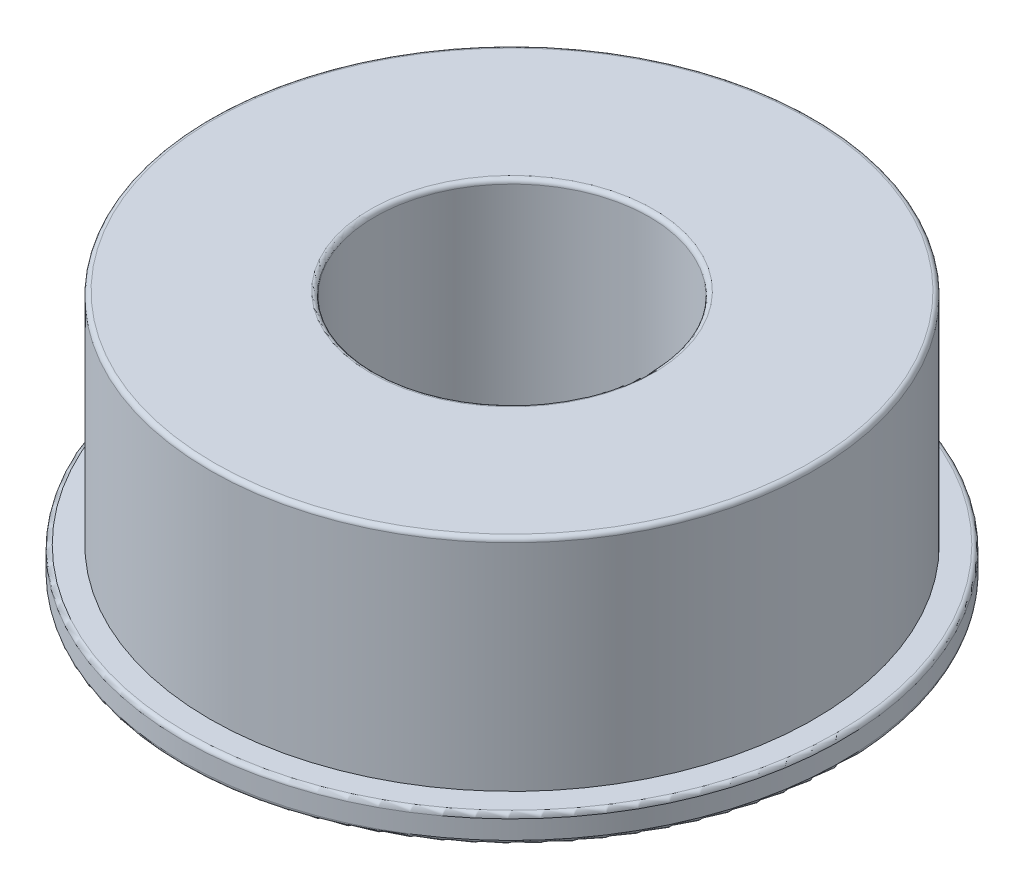
ISO-10303-21;
HEADER;
FILE_DESCRIPTION(('STEP AP214'),'2;1');
FILE_NAME('part.step','',(''),(''),'','','');
FILE_SCHEMA(('AUTOMOTIVE_DESIGN { 1 0 10303 214 1 1 1 1 }'));
ENDSEC;
DATA;
#1=APPLICATION_CONTEXT('core data for automotive mechanical design processes');
#2=APPLICATION_PROTOCOL_DEFINITION('international standard','automotive_design',2000,#1);
#3=PRODUCT_CONTEXT('',#1,'mechanical');
#4=PRODUCT('Part','Part','',(#3));
#5=PRODUCT_RELATED_PRODUCT_CATEGORY('part','',(#4));
#6=PRODUCT_DEFINITION_FORMATION('','',#4);
#7=PRODUCT_DEFINITION_CONTEXT('part definition',#1,'design');
#8=PRODUCT_DEFINITION('design','',#6,#7);
#9=PRODUCT_DEFINITION_SHAPE('','',#8);
#10=(LENGTH_UNIT() NAMED_UNIT(*) SI_UNIT(.MILLI.,.METRE.));
#11=(NAMED_UNIT(*) PLANE_ANGLE_UNIT() SI_UNIT($,.RADIAN.));
#12=(NAMED_UNIT(*) SI_UNIT($,.STERADIAN.) SOLID_ANGLE_UNIT());
#13=UNCERTAINTY_MEASURE_WITH_UNIT(LENGTH_MEASURE(1.E-05),#10,'distance_accuracy_value','');
#14=(GEOMETRIC_REPRESENTATION_CONTEXT(3) GLOBAL_UNCERTAINTY_ASSIGNED_CONTEXT((#13)) GLOBAL_UNIT_ASSIGNED_CONTEXT((#10,
#11,#12)) REPRESENTATION_CONTEXT('',''));
#15=CARTESIAN_POINT('',(0.,0.,0.));
#16=DIRECTION('',(0.,0.,1.));
#17=DIRECTION('',(1.,0.,0.));
#18=AXIS2_PLACEMENT_3D('',#15,#16,#17);
#19=CARTESIAN_POINT('',(0.,1.5875,0.));
#20=DIRECTION('',(0.,1.,0.));
#21=DIRECTION('',(0.,0.,1.));
#22=AXIS2_PLACEMENT_3D('',#19,#20,#21);
#23=PLANE('',#22);
#24=CARTESIAN_POINT('',(0.,1.5875,0.));
#25=DIRECTION('',(0.,1.,0.));
#26=DIRECTION('',(0.,0.,1.));
#27=AXIS2_PLACEMENT_3D('',#24,#25,#26);
#28=CIRCLE('',#27,18.796);
#29=CARTESIAN_POINT('',(0.,1.5875,18.796));
#30=VERTEX_POINT('',#29);
#31=EDGE_CURVE('E38',#30,#30,#28,.T.);
#32=ORIENTED_EDGE('',*,*,#31,.T.);
#33=EDGE_LOOP('',(#32));
#34=FACE_BOUND('',#33,.T.);
#35=CARTESIAN_POINT('',(0.,1.5875,0.));
#36=DIRECTION('',(0.,1.,0.));
#37=DIRECTION('',(0.,0.,1.));
#38=AXIS2_PLACEMENT_3D('',#35,#36,#37);
#39=CIRCLE('',#38,17.4625);
#40=CARTESIAN_POINT('',(0.,1.5875,17.4625));
#41=VERTEX_POINT('',#40);
#42=EDGE_CURVE('E63',#41,#41,#39,.T.);
#43=ORIENTED_EDGE('',*,*,#42,.F.);
#44=EDGE_LOOP('',(#43));
#45=FACE_BOUND('',#44,.T.);
#46=ADVANCED_FACE('F31',(#34,#45),#23,.T.);
#47=CARTESIAN_POINT('',(0.,1.5875,0.));
#48=DIRECTION('',(0.,-1.,0.));
#49=DIRECTION('',(0.,0.,-1.));
#50=AXIS2_PLACEMENT_3D('',#47,#48,#49);
#51=CYLINDRICAL_SURFACE('',#50,19.05);
#52=CARTESIAN_POINT('',(0.,0.254,0.));
#53=DIRECTION('',(0.,1.,0.));
#54=DIRECTION('',(0.,0.,1.));
#55=AXIS2_PLACEMENT_3D('',#52,#53,#54);
#56=CIRCLE('',#55,19.05);
#57=CARTESIAN_POINT('',(0.,0.254,19.05));
#58=VERTEX_POINT('',#57);
#59=EDGE_CURVE('E46',#58,#58,#56,.T.);
#60=ORIENTED_EDGE('',*,*,#59,.T.);
#61=EDGE_LOOP('',(#60));
#62=FACE_BOUND('',#61,.T.);
#63=CARTESIAN_POINT('',(0.,1.3335,0.));
#64=DIRECTION('',(0.,1.,0.));
#65=DIRECTION('',(0.,0.,1.));
#66=AXIS2_PLACEMENT_3D('',#63,#64,#65);
#67=CIRCLE('',#66,19.05);
#68=CARTESIAN_POINT('',(0.,1.3335,19.05));
#69=VERTEX_POINT('',#68);
#70=EDGE_CURVE('E51',#69,#69,#67,.F.);
#71=ORIENTED_EDGE('',*,*,#70,.T.);
#72=EDGE_LOOP('',(#71));
#73=FACE_BOUND('',#72,.T.);
#74=ADVANCED_FACE('F89',(#62,#73),#51,.T.);
#75=CARTESIAN_POINT('',(0.,0.,0.));
#76=DIRECTION('',(0.,1.,0.));
#77=DIRECTION('',(0.,0.,1.));
#78=AXIS2_PLACEMENT_3D('',#75,#76,#77);
#79=PLANE('',#78);
#80=CARTESIAN_POINT('',(0.,0.,0.));
#81=DIRECTION('',(0.,1.,0.));
#82=DIRECTION('',(0.,0.,1.));
#83=AXIS2_PLACEMENT_3D('',#80,#81,#82);
#84=CIRCLE('',#83,18.796);
#85=CARTESIAN_POINT('',(0.,0.,18.796));
#86=VERTEX_POINT('',#85);
#87=EDGE_CURVE('E42',#86,#86,#84,.F.);
#88=ORIENTED_EDGE('',*,*,#87,.T.);
#89=EDGE_LOOP('',(#88));
#90=FACE_BOUND('',#89,.T.);
#91=CARTESIAN_POINT('',(0.,0.,0.));
#92=DIRECTION('',(0.,1.,0.));
#93=DIRECTION('',(0.,0.,1.));
#94=AXIS2_PLACEMENT_3D('',#91,#92,#93);
#95=CIRCLE('',#94,7.9375);
#96=CARTESIAN_POINT('',(0.,0.,7.9375));
#97=VERTEX_POINT('',#96);
#98=EDGE_CURVE('E66',#97,#97,#95,.T.);
#99=ORIENTED_EDGE('',*,*,#98,.T.);
#100=EDGE_LOOP('',(#99));
#101=FACE_BOUND('',#100,.T.);
#102=ADVANCED_FACE('F70',(#90,#101),#79,.F.);
#103=CARTESIAN_POINT('',(0.,14.2875,0.));
#104=DIRECTION('',(0.,-1.,0.));
#105=DIRECTION('',(0.,0.,-1.));
#106=AXIS2_PLACEMENT_3D('',#103,#104,#105);
#107=CYLINDRICAL_SURFACE('',#106,17.4625);
#108=CARTESIAN_POINT('',(0.,14.0335,0.));
#109=DIRECTION('',(0.,1.,0.));
#110=DIRECTION('',(0.,0.,1.));
#111=AXIS2_PLACEMENT_3D('',#108,#109,#110);
#112=CIRCLE('',#111,17.4625);
#113=CARTESIAN_POINT('',(0.,14.0335,17.4625));
#114=VERTEX_POINT('',#113);
#115=EDGE_CURVE('E10',#114,#114,#112,.F.);
#116=ORIENTED_EDGE('',*,*,#115,.T.);
#117=EDGE_LOOP('',(#116));
#118=FACE_BOUND('',#117,.T.);
#119=ORIENTED_EDGE('',*,*,#42,.T.);
#120=EDGE_LOOP('',(#119));
#121=FACE_BOUND('',#120,.T.);
#122=ADVANCED_FACE('F85',(#118,#121),#107,.T.);
#123=CARTESIAN_POINT('',(0.,14.2875,0.));
#124=DIRECTION('',(0.,1.,0.));
#125=DIRECTION('',(0.,0.,1.));
#126=AXIS2_PLACEMENT_3D('',#123,#124,#125);
#127=PLANE('',#126);
#128=CARTESIAN_POINT('',(0.,14.2875,0.));
#129=DIRECTION('',(0.,1.,0.));
#130=DIRECTION('',(0.,0.,1.));
#131=AXIS2_PLACEMENT_3D('',#128,#129,#130);
#132=CIRCLE('',#131,8.1915);
#133=CARTESIAN_POINT('',(0.,14.2875,8.1915));
#134=VERTEX_POINT('',#133);
#135=EDGE_CURVE('E54',#134,#134,#132,.F.);
#136=ORIENTED_EDGE('',*,*,#135,.T.);
#137=EDGE_LOOP('',(#136));
#138=FACE_BOUND('',#137,.T.);
#139=CARTESIAN_POINT('',(0.,14.2875,0.));
#140=DIRECTION('',(0.,1.,0.));
#141=DIRECTION('',(0.,0.,1.));
#142=AXIS2_PLACEMENT_3D('',#139,#140,#141);
#143=CIRCLE('',#142,17.2085);
#144=CARTESIAN_POINT('',(0.,14.2875,17.2085));
#145=VERTEX_POINT('',#144);
#146=EDGE_CURVE('E57',#145,#145,#143,.T.);
#147=ORIENTED_EDGE('',*,*,#146,.T.);
#148=EDGE_LOOP('',(#147));
#149=FACE_BOUND('',#148,.T.);
#150=ADVANCED_FACE('F75',(#138,#149),#127,.T.);
#151=CARTESIAN_POINT('',(0.,0.,0.));
#152=DIRECTION('',(0.,1.,0.));
#153=DIRECTION('',(0.,0.,1.));
#154=AXIS2_PLACEMENT_3D('',#151,#152,#153);
#155=CYLINDRICAL_SURFACE('',#154,7.9375);
#156=CARTESIAN_POINT('',(0.,14.0335,0.));
#157=DIRECTION('',(0.,1.,0.));
#158=DIRECTION('',(0.,0.,1.));
#159=AXIS2_PLACEMENT_3D('',#156,#157,#158);
#160=CIRCLE('',#159,7.9375);
#161=CARTESIAN_POINT('',(0.,14.0335,7.9375));
#162=VERTEX_POINT('',#161);
#163=EDGE_CURVE('E60',#162,#162,#160,.T.);
#164=ORIENTED_EDGE('',*,*,#163,.T.);
#165=EDGE_LOOP('',(#164));
#166=FACE_BOUND('',#165,.T.);
#167=ORIENTED_EDGE('',*,*,#98,.F.);
#168=EDGE_LOOP('',(#167));
#169=FACE_BOUND('',#168,.T.);
#170=ADVANCED_FACE('F72',(#166,#169),#155,.F.);
#171=CARTESIAN_POINT('',(0.,14.0335,0.));
#172=DIRECTION('',(0.,1.,0.));
#173=DIRECTION('',(0.,0.,1.));
#174=AXIS2_PLACEMENT_3D('',#171,#172,#173);
#175=TOROIDAL_SURFACE('',#174,8.1915,0.254);
#176=ORIENTED_EDGE('',*,*,#135,.F.);
#177=EDGE_LOOP('',(#176));
#178=FACE_BOUND('',#177,.T.);
#179=ORIENTED_EDGE('',*,*,#163,.F.);
#180=EDGE_LOOP('',(#179));
#181=FACE_BOUND('',#180,.T.);
#182=ADVANCED_FACE('F74',(#178,#181),#175,.T.);
#183=CARTESIAN_POINT('',(0.,0.254,0.));
#184=DIRECTION('',(0.,1.,0.));
#185=DIRECTION('',(0.,0.,1.));
#186=AXIS2_PLACEMENT_3D('',#183,#184,#185);
#187=TOROIDAL_SURFACE('',#186,18.796,0.254);
#188=ORIENTED_EDGE('',*,*,#87,.F.);
#189=EDGE_LOOP('',(#188));
#190=FACE_BOUND('',#189,.T.);
#191=ORIENTED_EDGE('',*,*,#59,.F.);
#192=EDGE_LOOP('',(#191));
#193=FACE_BOUND('',#192,.T.);
#194=ADVANCED_FACE('F82',(#190,#193),#187,.T.);
#195=CARTESIAN_POINT('',(0.,1.3335,0.));
#196=DIRECTION('',(0.,1.,0.));
#197=DIRECTION('',(0.,0.,1.));
#198=AXIS2_PLACEMENT_3D('',#195,#196,#197);
#199=TOROIDAL_SURFACE('',#198,18.796,0.254);
#200=ORIENTED_EDGE('',*,*,#70,.F.);
#201=EDGE_LOOP('',(#200));
#202=FACE_BOUND('',#201,.T.);
#203=ORIENTED_EDGE('',*,*,#31,.F.);
#204=EDGE_LOOP('',(#203));
#205=FACE_BOUND('',#204,.T.);
#206=ADVANCED_FACE('F103',(#202,#205),#199,.T.);
#207=CARTESIAN_POINT('',(0.,14.0335,0.));
#208=DIRECTION('',(0.,1.,0.));
#209=DIRECTION('',(0.,0.,1.));
#210=AXIS2_PLACEMENT_3D('',#207,#208,#209);
#211=TOROIDAL_SURFACE('',#210,17.2085,0.254);
#212=ORIENTED_EDGE('',*,*,#115,.F.);
#213=EDGE_LOOP('',(#212));
#214=FACE_BOUND('',#213,.T.);
#215=ORIENTED_EDGE('',*,*,#146,.F.);
#216=EDGE_LOOP('',(#215));
#217=FACE_BOUND('',#216,.T.);
#218=ADVANCED_FACE('F33',(#214,#217),#211,.T.);
#219=CLOSED_SHELL('',(#46,#74,#102,#122,#150,#170,#182,#194,#206,#218));
#220=MANIFOLD_SOLID_BREP('B2',#219);
#221=ADVANCED_BREP_SHAPE_REPRESENTATION('',(#18,#220),#14);
#222=SHAPE_DEFINITION_REPRESENTATION(#9,#221);
ENDSEC;
END-ISO-10303-21;
